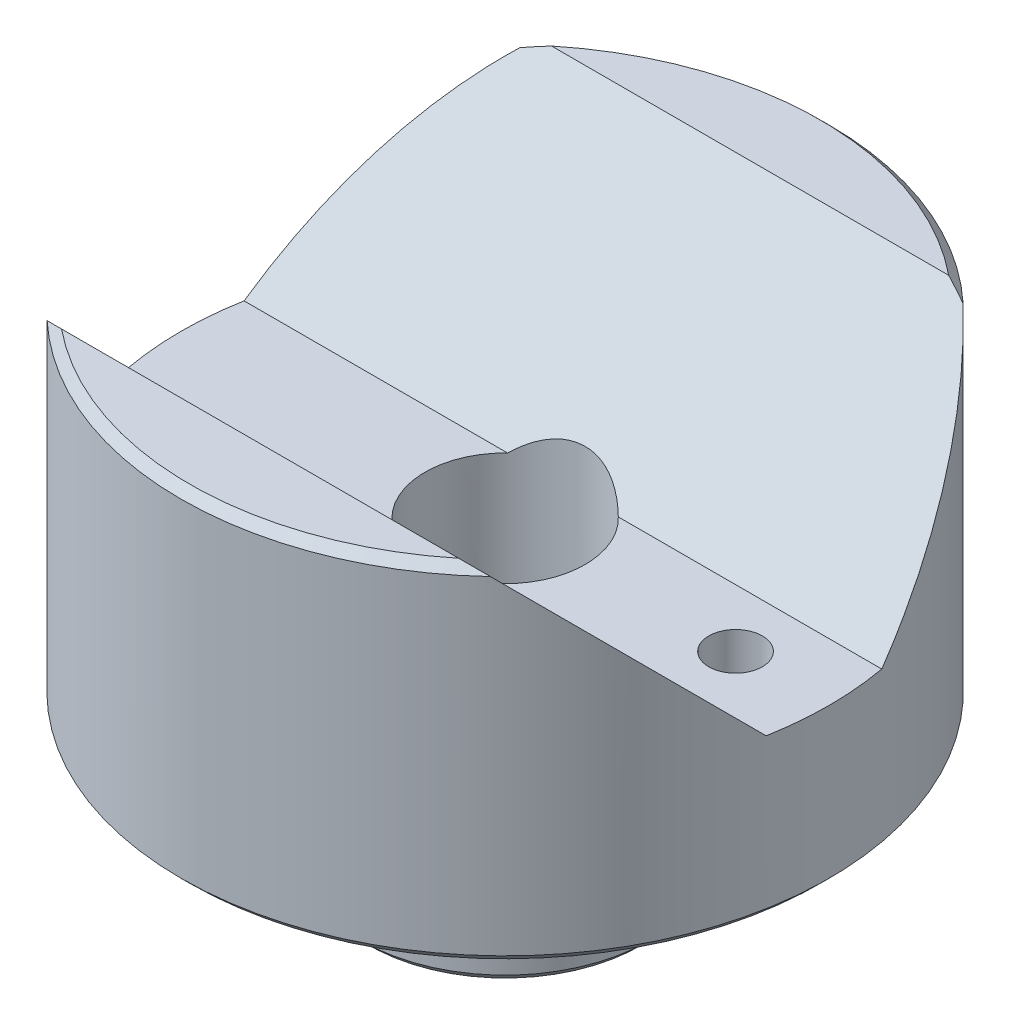
ISO-10303-21;
HEADER;
FILE_DESCRIPTION(('STEP AP214'),'2;1');
FILE_NAME('part.step','',(''),(''),'','','');
FILE_SCHEMA(('AUTOMOTIVE_DESIGN { 1 0 10303 214 1 1 1 1 }'));
ENDSEC;
DATA;
#1=APPLICATION_CONTEXT('core data for automotive mechanical design processes');
#2=APPLICATION_PROTOCOL_DEFINITION('international standard','automotive_design',2000,#1);
#3=PRODUCT_CONTEXT('',#1,'mechanical');
#4=PRODUCT('Part','Part','',(#3));
#5=PRODUCT_RELATED_PRODUCT_CATEGORY('part','',(#4));
#6=PRODUCT_DEFINITION_FORMATION('','',#4);
#7=PRODUCT_DEFINITION_CONTEXT('part definition',#1,'design');
#8=PRODUCT_DEFINITION('design','',#6,#7);
#9=PRODUCT_DEFINITION_SHAPE('','',#8);
#10=(LENGTH_UNIT() NAMED_UNIT(*) SI_UNIT(.MILLI.,.METRE.));
#11=(NAMED_UNIT(*) PLANE_ANGLE_UNIT() SI_UNIT($,.RADIAN.));
#12=(NAMED_UNIT(*) SI_UNIT($,.STERADIAN.) SOLID_ANGLE_UNIT());
#13=UNCERTAINTY_MEASURE_WITH_UNIT(LENGTH_MEASURE(1.E-05),#10,'distance_accuracy_value','');
#14=(GEOMETRIC_REPRESENTATION_CONTEXT(3) GLOBAL_UNCERTAINTY_ASSIGNED_CONTEXT((#13)) GLOBAL_UNIT_ASSIGNED_CONTEXT((#10,
#11,#12)) REPRESENTATION_CONTEXT('',''));
#15=CARTESIAN_POINT('',(0.,0.,0.));
#16=DIRECTION('',(0.,0.,1.));
#17=DIRECTION('',(1.,0.,0.));
#18=AXIS2_PLACEMENT_3D('',#15,#16,#17);
#19=CARTESIAN_POINT('',(0.,0.,0.));
#20=DIRECTION('',(0.,1.,0.));
#21=DIRECTION('',(0.,0.,1.));
#22=AXIS2_PLACEMENT_3D('',#19,#20,#21);
#23=PLANE('',#22);
#24=CARTESIAN_POINT('',(10.16,0.,0.));
#25=DIRECTION('',(0.,1.,0.));
#26=DIRECTION('',(0.,0.,1.));
#27=AXIS2_PLACEMENT_3D('',#24,#25,#26);
#28=CIRCLE('',#27,1.1811);
#29=CARTESIAN_POINT('',(10.16,0.,1.1811));
#30=VERTEX_POINT('',#29);
#31=EDGE_CURVE('E288',#30,#30,#28,.T.);
#32=ORIENTED_EDGE('',*,*,#31,.T.);
#33=EDGE_LOOP('',(#32));
#34=FACE_BOUND('',#33,.T.);
#35=CARTESIAN_POINT('',(0.,0.,0.));
#36=DIRECTION('',(0.,1.,0.));
#37=DIRECTION('',(0.,0.,1.));
#38=AXIS2_PLACEMENT_3D('',#35,#36,#37);
#39=CIRCLE('',#38,13.9065);
#40=CARTESIAN_POINT('',(0.,0.,13.9065));
#41=VERTEX_POINT('',#40);
#42=EDGE_CURVE('E14',#41,#41,#39,.F.);
#43=ORIENTED_EDGE('',*,*,#42,.T.);
#44=EDGE_LOOP('',(#43));
#45=FACE_BOUND('',#44,.T.);
#46=CARTESIAN_POINT('',(0.,0.,0.));
#47=DIRECTION('',(0.,1.,0.));
#48=DIRECTION('',(0.,0.,1.));
#49=AXIS2_PLACEMENT_3D('',#46,#47,#48);
#50=CIRCLE('',#49,7.24948711325939);
#51=CARTESIAN_POINT('',(0.,0.,7.24948711325939));
#52=VERTEX_POINT('',#51);
#53=EDGE_CURVE('E293',#52,#52,#50,.F.);
#54=ORIENTED_EDGE('',*,*,#53,.F.);
#55=EDGE_LOOP('',(#54));
#56=FACE_BOUND('',#55,.T.);
#57=ADVANCED_FACE('F84',(#34,#45,#56),#23,.F.);
#58=CARTESIAN_POINT('',(0.,-6.35,0.));
#59=DIRECTION('',(0.,1.,0.));
#60=DIRECTION('',(0.,0.,1.));
#61=AXIS2_PLACEMENT_3D('',#58,#59,#60);
#62=CYLINDRICAL_SURFACE('',#61,6.35);
#63=CARTESIAN_POINT('',(0.,-5.969,0.));
#64=DIRECTION('',(0.,-1.,0.));
#65=DIRECTION('',(0.,0.,-1.));
#66=AXIS2_PLACEMENT_3D('',#63,#64,#65);
#67=CIRCLE('',#66,6.35);
#68=CARTESIAN_POINT('',(0.,-5.969,-6.35));
#69=VERTEX_POINT('',#68);
#70=EDGE_CURVE('E212',#69,#69,#67,.F.);
#71=ORIENTED_EDGE('',*,*,#70,.T.);
#72=EDGE_LOOP('',(#71));
#73=FACE_BOUND('',#72,.T.);
#74=CARTESIAN_POINT('',(0.,-0.803926131403118,0.));
#75=DIRECTION('',(0.,1.,0.));
#76=DIRECTION('',(0.,0.,1.));
#77=AXIS2_PLACEMENT_3D('',#74,#75,#76);
#78=CIRCLE('',#77,6.35);
#79=CARTESIAN_POINT('',(0.,-0.803926131403118,6.35));
#80=VERTEX_POINT('',#79);
#81=EDGE_CURVE('E88',#80,#80,#78,.T.);
#82=ORIENTED_EDGE('',*,*,#81,.F.);
#83=EDGE_LOOP('',(#82));
#84=FACE_BOUND('',#83,.T.);
#85=ADVANCED_FACE('F240',(#73,#84),#62,.T.);
#86=CARTESIAN_POINT('',(-14.2875,6.985,-2.54838418160373));
#87=DIRECTION('',(0.,-1.,0.));
#88=DIRECTION('',(0.,0.,-1.));
#89=AXIS2_PLACEMENT_3D('',#86,#87,#88);
#90=PLANE('',#89);
#91=CARTESIAN_POINT('',(0.,6.985,0.));
#92=DIRECTION('',(0.,-1.,0.));
#93=DIRECTION('',(0.,0.,-1.));
#94=AXIS2_PLACEMENT_3D('',#91,#92,#93);
#95=CIRCLE('',#94,3.5306);
#96=CARTESIAN_POINT('',(-2.44353727676742,6.985,-2.54838418160373));
#97=VERTEX_POINT('',#96);
#98=CARTESIAN_POINT('',(-2.44353727676741,6.985,2.54838418160373));
#99=VERTEX_POINT('',#98);
#100=EDGE_CURVE('E154',#97,#99,#95,.F.);
#101=ORIENTED_EDGE('',*,*,#100,.F.);
#102=DIRECTION('',(1.,0.,0.));
#103=VECTOR('',#102,1.);
#104=CARTESIAN_POINT('',(-14.2875,6.985,-2.54838418160373));
#105=LINE('',#104,#103);
#106=CARTESIAN_POINT('',(-14.0583923089716,6.985,-2.54838418160373));
#107=VERTEX_POINT('',#106);
#108=EDGE_CURVE('E170',#107,#97,#105,.T.);
#109=ORIENTED_EDGE('',*,*,#108,.F.);
#110=CARTESIAN_POINT('',(0.,6.985,0.));
#111=DIRECTION('',(0.,-1.,0.));
#112=DIRECTION('',(0.,0.,-1.));
#113=AXIS2_PLACEMENT_3D('',#110,#111,#112);
#114=CIRCLE('',#113,14.2875);
#115=CARTESIAN_POINT('',(-14.0583923089716,6.985,2.54838418160373));
#116=VERTEX_POINT('',#115);
#117=EDGE_CURVE('E163',#116,#107,#114,.T.);
#118=ORIENTED_EDGE('',*,*,#117,.F.);
#119=DIRECTION('',(1.,0.,0.));
#120=VECTOR('',#119,1.);
#121=CARTESIAN_POINT('',(-14.2875,6.985,2.54838418160373));
#122=LINE('',#121,#120);
#123=EDGE_CURVE('E173',#116,#99,#122,.T.);
#124=ORIENTED_EDGE('',*,*,#123,.T.);
#125=EDGE_LOOP('',(#101,#109,#118,#124));
#126=FACE_BOUND('',#125,.T.);
#127=ADVANCED_FACE('F168',(#126),#90,.F.);
#128=CARTESIAN_POINT('',(10.16,6.985,0.));
#129=DIRECTION('',(0.,1.,0.));
#130=DIRECTION('',(0.,0.,1.));
#131=AXIS2_PLACEMENT_3D('',#128,#129,#130);
#132=CIRCLE('',#131,1.1811);
#133=CARTESIAN_POINT('',(10.16,6.985,1.1811));
#134=VERTEX_POINT('',#133);
#135=EDGE_CURVE('E302',#134,#134,#132,.T.);
#136=ORIENTED_EDGE('',*,*,#135,.F.);
#137=EDGE_LOOP('',(#136));
#138=FACE_BOUND('',#137,.T.);
#139=CARTESIAN_POINT('',(2.44353727676741,6.985,2.54838418160373));
#140=VERTEX_POINT('',#139);
#141=CARTESIAN_POINT('',(2.4435372767674,6.985,-2.54838418160373));
#142=VERTEX_POINT('',#141);
#143=EDGE_CURVE('E157',#140,#142,#95,.F.);
#144=ORIENTED_EDGE('',*,*,#143,.F.);
#145=CARTESIAN_POINT('',(14.0583923089716,6.985,2.54838418160373));
#146=VERTEX_POINT('',#145);
#147=EDGE_CURVE('E186',#140,#146,#122,.T.);
#148=ORIENTED_EDGE('',*,*,#147,.T.);
#149=CARTESIAN_POINT('',(14.0583923089716,6.985,-2.54838418160373));
#150=VERTEX_POINT('',#149);
#151=EDGE_CURVE('E195',#150,#146,#114,.T.);
#152=ORIENTED_EDGE('',*,*,#151,.F.);
#153=EDGE_CURVE('E181',#142,#150,#105,.T.);
#154=ORIENTED_EDGE('',*,*,#153,.F.);
#155=EDGE_LOOP('',(#144,#148,#152,#154));
#156=FACE_BOUND('',#155,.T.);
#157=ADVANCED_FACE('F245',(#138,#156),#90,.F.);
#158=CARTESIAN_POINT('',(-14.2875,6.985,2.54838418160373));
#159=DIRECTION('',(0.,-0.707106781186548,0.707106781186547));
#160=DIRECTION('',(0.,-0.707106781186547,-0.707106781186548));
#161=AXIS2_PLACEMENT_3D('',#158,#159,#160);
#162=PLANE('',#161);
#163=DIRECTION('',(1.,0.,0.));
#164=VECTOR('',#163,1.);
#165=CARTESIAN_POINT('',(0.,15.24,10.8033841816037));
#166=LINE('',#165,#164);
#167=CARTESIAN_POINT('',(-8.7565765270838,15.24,10.8033841816037));
#168=VERTEX_POINT('',#167);
#169=CARTESIAN_POINT('',(8.7565765270838,15.24,10.8033841816037));
#170=VERTEX_POINT('',#169);
#171=EDGE_CURVE('E193',#168,#170,#166,.T.);
#172=ORIENTED_EDGE('',*,*,#171,.T.);
#173=CARTESIAN_POINT('',(8.7565765270838,15.24,10.8033841816037));
#174=CARTESIAN_POINT('',(8.84227947885759,15.2096289773404,10.7730131589442));
#175=CARTESIAN_POINT('',(8.92772964032835,15.1789016635917,10.7422858451955));
#176=CARTESIAN_POINT('',(9.09811127153115,15.1167549928,10.6801391744038));
#177=CARTESIAN_POINT('',(9.1830428066349,15.0853357253763,10.64871990698));
#178=CARTESIAN_POINT('',(9.3523957525754,15.0218180037477,10.5852021853514));
#179=CARTESIAN_POINT('',(9.43681716577958,14.989719552698,10.5531037343017));
#180=CARTESIAN_POINT('',(9.6051598288421,14.9248553166724,10.4882394982762));
#181=CARTESIAN_POINT('',(9.68908101288975,14.8920894462902,10.4554736278939));
#182=CARTESIAN_POINT('',(9.77274599184159,14.859,10.4223841816038));
#183=B_SPLINE_CURVE_WITH_KNOTS('',3,(#173,#174,#175,#176,#177,#178,#179,#180,#181,#182),
.UNSPECIFIED.,.F.,.F.,(4,2,2,2,4),(0.,0.287588236579071,0.575139442343968,0.862689312573672,
1.15027621324248),.UNSPECIFIED.);
#184=CARTESIAN_POINT('',(9.77274599184159,14.859,10.4223841816038));
#185=VERTEX_POINT('',#184);
#186=EDGE_CURVE('E93',#170,#185,#183,.T.);
#187=ORIENTED_EDGE('',*,*,#186,.T.);
#188=CARTESIAN_POINT('',(0.,4.43661581839627,0.));
#189=DIRECTION('',(0.,-0.707106781186548,0.707106781186547));
#190=DIRECTION('',(0.,-0.707106781186547,-0.707106781186548));
#191=AXIS2_PLACEMENT_3D('',#188,#189,#190);
#192=ELLIPSE('',#191,20.2055762724056,14.2875);
#193=EDGE_CURVE('E190',#146,#185,#192,.T.);
#194=ORIENTED_EDGE('',*,*,#193,.F.);
#195=ORIENTED_EDGE('',*,*,#147,.F.);
#196=CARTESIAN_POINT('',(0.,4.43661581839627,0.));
#197=DIRECTION('',(0.,-0.707106781186548,0.707106781186547));
#198=DIRECTION('',(0.,0.707106781186547,0.707106781186548));
#199=AXIS2_PLACEMENT_3D('',#196,#197,#198);
#200=ELLIPSE('',#199,4.99302240331445,3.5306);
#201=EDGE_CURVE('E174',#99,#140,#200,.F.);
#202=ORIENTED_EDGE('',*,*,#201,.F.);
#203=ORIENTED_EDGE('',*,*,#123,.F.);
#204=CARTESIAN_POINT('',(-9.77274599184159,14.859,10.4223841816038));
#205=VERTEX_POINT('',#204);
#206=EDGE_CURVE('E188',#205,#116,#192,.T.);
#207=ORIENTED_EDGE('',*,*,#206,.F.);
#208=CARTESIAN_POINT('',(-9.77274599184159,14.859,10.4223841816038));
#209=CARTESIAN_POINT('',(-9.68908101288975,14.8920894462902,10.4554736278939));
#210=CARTESIAN_POINT('',(-9.6051598288421,14.9248553166724,10.4882394982762));
#211=CARTESIAN_POINT('',(-9.43681716577958,14.989719552698,10.5531037343017));
#212=CARTESIAN_POINT('',(-9.3523957525754,15.0218180037477,10.5852021853514));
#213=CARTESIAN_POINT('',(-9.1830428066349,15.0853357253763,10.64871990698));
#214=CARTESIAN_POINT('',(-9.09811127153115,15.1167549928,10.6801391744038));
#215=CARTESIAN_POINT('',(-8.92772964032835,15.1789016635917,10.7422858451955));
#216=CARTESIAN_POINT('',(-8.84227947885759,15.2096289773404,10.7730131589442));
#217=CARTESIAN_POINT('',(-8.7565765270838,15.24,10.8033841816037));
#218=B_SPLINE_CURVE_WITH_KNOTS('',3,(#208,#209,#210,#211,#212,#213,#214,#215,#216,#217),
.UNSPECIFIED.,.F.,.F.,(4,2,2,2,4),(0.,0.287586900668809,0.575136770898513,0.862687976663411,
1.15027621324248),.UNSPECIFIED.);
#219=EDGE_CURVE('E107',#205,#168,#218,.T.);
#220=ORIENTED_EDGE('',*,*,#219,.T.);
#221=EDGE_LOOP('',(#172,#187,#194,#195,#202,#203,#207,#220));
#222=FACE_BOUND('',#221,.T.);
#223=ADVANCED_FACE('F239',(#222),#162,.F.);
#224=CARTESIAN_POINT('',(-14.2875,15.24,-10.8033841816037));
#225=DIRECTION('',(0.,-0.707106781186548,-0.707106781186547));
#226=DIRECTION('',(0.,0.707106781186547,-0.707106781186548));
#227=AXIS2_PLACEMENT_3D('',#224,#225,#226);
#228=PLANE('',#227);
#229=DIRECTION('',(-1.,0.,0.));
#230=VECTOR('',#229,1.);
#231=CARTESIAN_POINT('',(0.,15.24,-10.8033841816037));
#232=LINE('',#231,#230);
#233=CARTESIAN_POINT('',(8.7565765270838,15.24,-10.8033841816037));
#234=VERTEX_POINT('',#233);
#235=CARTESIAN_POINT('',(-8.7565765270838,15.24,-10.8033841816037));
#236=VERTEX_POINT('',#235);
#237=EDGE_CURVE('E191',#234,#236,#232,.T.);
#238=ORIENTED_EDGE('',*,*,#237,.T.);
#239=CARTESIAN_POINT('',(-8.7565765270838,15.24,-10.8033841816037));
#240=CARTESIAN_POINT('',(-8.84227947885759,15.2096289773404,-10.7730131589442));
#241=CARTESIAN_POINT('',(-8.92772964032835,15.1789016635917,-10.7422858451955));
#242=CARTESIAN_POINT('',(-9.09811127153116,15.1167549928,-10.6801391744038));
#243=CARTESIAN_POINT('',(-9.18304280663491,15.0853357253763,-10.64871990698));
#244=CARTESIAN_POINT('',(-9.3523957525754,15.0218180037477,-10.5852021853514));
#245=CARTESIAN_POINT('',(-9.43681716577959,14.989719552698,-10.5531037343017));
#246=CARTESIAN_POINT('',(-9.60515982884211,14.9248553166724,-10.4882394982762));
#247=CARTESIAN_POINT('',(-9.68908101288976,14.8920894462902,-10.4554736278939));
#248=CARTESIAN_POINT('',(-9.77274599184159,14.859,-10.4223841816038));
#249=B_SPLINE_CURVE_WITH_KNOTS('',3,(#239,#240,#241,#242,#243,#244,#245,#246,#247,#248),
.UNSPECIFIED.,.F.,.F.,(4,2,2,2,4),(0.,0.287588236579072,0.575139442343968,0.862689312573673,
1.15027621324248),.UNSPECIFIED.);
#250=CARTESIAN_POINT('',(-9.77274599184159,14.859,-10.4223841816038));
#251=VERTEX_POINT('',#250);
#252=EDGE_CURVE('E225',#236,#251,#249,.T.);
#253=ORIENTED_EDGE('',*,*,#252,.T.);
#254=CARTESIAN_POINT('',(0.,4.43661581839627,0.));
#255=DIRECTION('',(0.,-0.707106781186548,-0.707106781186547));
#256=DIRECTION('',(0.,-0.707106781186547,0.707106781186548));
#257=AXIS2_PLACEMENT_3D('',#254,#255,#256);
#258=ELLIPSE('',#257,20.2055762724056,14.2875);
#259=EDGE_CURVE('E179',#107,#251,#258,.T.);
#260=ORIENTED_EDGE('',*,*,#259,.F.);
#261=ORIENTED_EDGE('',*,*,#108,.T.);
#262=CARTESIAN_POINT('',(0.,4.43661581839627,0.));
#263=DIRECTION('',(0.,-0.707106781186548,-0.707106781186547));
#264=DIRECTION('',(0.,0.707106781186547,-0.707106781186548));
#265=AXIS2_PLACEMENT_3D('',#262,#263,#264);
#266=ELLIPSE('',#265,4.99302240331445,3.5306);
#267=EDGE_CURVE('E151',#142,#97,#266,.F.);
#268=ORIENTED_EDGE('',*,*,#267,.F.);
#269=ORIENTED_EDGE('',*,*,#153,.T.);
#270=CARTESIAN_POINT('',(9.77274599184159,14.859,-10.4223841816038));
#271=VERTEX_POINT('',#270);
#272=EDGE_CURVE('E180',#271,#150,#258,.T.);
#273=ORIENTED_EDGE('',*,*,#272,.F.);
#274=CARTESIAN_POINT('',(9.77274599184159,14.859,-10.4223841816038));
#275=CARTESIAN_POINT('',(9.68908101288976,14.8920894462902,-10.4554736278939));
#276=CARTESIAN_POINT('',(9.60515982884211,14.9248553166724,-10.4882394982762));
#277=CARTESIAN_POINT('',(9.43681716577959,14.989719552698,-10.5531037343017));
#278=CARTESIAN_POINT('',(9.3523957525754,15.0218180037477,-10.5852021853514));
#279=CARTESIAN_POINT('',(9.18304280663491,15.0853357253763,-10.64871990698));
#280=CARTESIAN_POINT('',(9.09811127153116,15.1167549928,-10.6801391744038));
#281=CARTESIAN_POINT('',(8.92772964032835,15.1789016635917,-10.7422858451955));
#282=CARTESIAN_POINT('',(8.84227947885759,15.2096289773404,-10.7730131589442));
#283=CARTESIAN_POINT('',(8.7565765270838,15.24,-10.8033841816037));
#284=B_SPLINE_CURVE_WITH_KNOTS('',3,(#274,#275,#276,#277,#278,#279,#280,#281,#282,#283),
.UNSPECIFIED.,.F.,.F.,(4,2,2,2,4),(0.,0.287586900668807,0.575136770898512,0.862687976663411,
1.15027621324248),.UNSPECIFIED.);
#285=EDGE_CURVE('E218',#271,#234,#284,.T.);
#286=ORIENTED_EDGE('',*,*,#285,.T.);
#287=EDGE_LOOP('',(#238,#253,#260,#261,#268,#269,#273,#286));
#288=FACE_BOUND('',#287,.T.);
#289=ADVANCED_FACE('F177',(#288),#228,.F.);
#290=CARTESIAN_POINT('',(0.,-6.35,0.));
#291=DIRECTION('',(0.,-1.,0.));
#292=DIRECTION('',(0.,0.,-1.));
#293=AXIS2_PLACEMENT_3D('',#290,#291,#292);
#294=PLANE('',#293);
#295=CARTESIAN_POINT('',(0.,-6.35,0.));
#296=DIRECTION('',(0.,-1.,0.));
#297=DIRECTION('',(0.,0.,-1.));
#298=AXIS2_PLACEMENT_3D('',#295,#296,#297);
#299=CIRCLE('',#298,5.969);
#300=CARTESIAN_POINT('',(0.,-6.35,-5.969));
#301=VERTEX_POINT('',#300);
#302=EDGE_CURVE('E209',#301,#301,#299,.T.);
#303=ORIENTED_EDGE('',*,*,#302,.T.);
#304=EDGE_LOOP('',(#303));
#305=FACE_BOUND('',#304,.T.);
#306=CARTESIAN_POINT('',(0.,-6.35,0.));
#307=DIRECTION('',(0.,-1.,0.));
#308=DIRECTION('',(0.,0.,-1.));
#309=AXIS2_PLACEMENT_3D('',#306,#307,#308);
#310=CIRCLE('',#309,3.175);
#311=CARTESIAN_POINT('',(0.,-6.35,-3.175));
#312=VERTEX_POINT('',#311);
#313=EDGE_CURVE('E162',#312,#312,#310,.F.);
#314=ORIENTED_EDGE('',*,*,#313,.T.);
#315=EDGE_LOOP('',(#314));
#316=FACE_BOUND('',#315,.T.);
#317=ADVANCED_FACE('F238',(#305,#316),#294,.T.);
#318=CARTESIAN_POINT('',(0.,15.24,0.));
#319=DIRECTION('',(0.,1.,0.));
#320=DIRECTION('',(0.,0.,1.));
#321=AXIS2_PLACEMENT_3D('',#318,#319,#320);
#322=PLANE('',#321);
#323=ORIENTED_EDGE('',*,*,#171,.F.);
#324=CARTESIAN_POINT('',(0.,15.24,0.));
#325=DIRECTION('',(0.,1.,0.));
#326=DIRECTION('',(0.,0.,1.));
#327=AXIS2_PLACEMENT_3D('',#324,#325,#326);
#328=CIRCLE('',#327,13.9065);
#329=EDGE_CURVE('E323',#168,#170,#328,.T.);
#330=ORIENTED_EDGE('',*,*,#329,.T.);
#331=EDGE_LOOP('',(#323,#330));
#332=FACE_BOUND('',#331,.T.);
#333=ADVANCED_FACE('F332',(#332),#322,.T.);
#334=CARTESIAN_POINT('',(0.,15.24,0.));
#335=DIRECTION('',(0.,-1.,0.));
#336=DIRECTION('',(0.,0.,-1.));
#337=AXIS2_PLACEMENT_3D('',#334,#335,#336);
#338=CYLINDRICAL_SURFACE('',#337,14.2875);
#339=CARTESIAN_POINT('',(0.,0.381000000000008,0.));
#340=DIRECTION('',(0.,1.,0.));
#341=DIRECTION('',(0.,0.,1.));
#342=AXIS2_PLACEMENT_3D('',#339,#340,#341);
#343=CIRCLE('',#342,14.2875);
#344=CARTESIAN_POINT('',(0.,0.381000000000008,14.2875));
#345=VERTEX_POINT('',#344);
#346=EDGE_CURVE('E321',#345,#345,#343,.T.);
#347=ORIENTED_EDGE('',*,*,#346,.T.);
#348=EDGE_LOOP('',(#347));
#349=FACE_BOUND('',#348,.T.);
#350=ORIENTED_EDGE('',*,*,#259,.T.);
#351=CARTESIAN_POINT('',(0.,14.859,0.));
#352=DIRECTION('',(0.,1.,0.));
#353=DIRECTION('',(0.,0.,1.));
#354=AXIS2_PLACEMENT_3D('',#351,#352,#353);
#355=CIRCLE('',#354,14.2875);
#356=EDGE_CURVE('E314',#251,#271,#355,.F.);
#357=ORIENTED_EDGE('',*,*,#356,.T.);
#358=ORIENTED_EDGE('',*,*,#272,.T.);
#359=ORIENTED_EDGE('',*,*,#151,.T.);
#360=ORIENTED_EDGE('',*,*,#193,.T.);
#361=CARTESIAN_POINT('',(0.,14.859,0.));
#362=DIRECTION('',(0.,1.,0.));
#363=DIRECTION('',(0.,0.,1.));
#364=AXIS2_PLACEMENT_3D('',#361,#362,#363);
#365=CIRCLE('',#364,14.2875);
#366=EDGE_CURVE('E322',#185,#205,#365,.F.);
#367=ORIENTED_EDGE('',*,*,#366,.T.);
#368=ORIENTED_EDGE('',*,*,#206,.T.);
#369=ORIENTED_EDGE('',*,*,#117,.T.);
#370=EDGE_LOOP('',(#350,#357,#358,#359,#360,#367,#368,#369));
#371=FACE_BOUND('',#370,.T.);
#372=ADVANCED_FACE('F86',(#349,#371),#338,.T.);
#373=ORIENTED_EDGE('',*,*,#237,.F.);
#374=CARTESIAN_POINT('',(0.,15.24,0.));
#375=DIRECTION('',(0.,1.,0.));
#376=DIRECTION('',(0.,0.,1.));
#377=AXIS2_PLACEMENT_3D('',#374,#375,#376);
#378=CIRCLE('',#377,13.9065);
#379=EDGE_CURVE('E215',#234,#236,#378,.T.);
#380=ORIENTED_EDGE('',*,*,#379,.T.);
#381=EDGE_LOOP('',(#373,#380));
#382=FACE_BOUND('',#381,.T.);
#383=ADVANCED_FACE('F320',(#382),#322,.T.);
#384=CARTESIAN_POINT('',(0.,13.9793934911243,0.));
#385=DIRECTION('',(0.,1.,0.));
#386=DIRECTION('',(0.,0.,1.));
#387=AXIS2_PLACEMENT_3D('',#384,#385,#386);
#388=CYLINDRICAL_SURFACE('',#387,3.5306);
#389=CARTESIAN_POINT('',(0.,0.635,0.));
#390=DIRECTION('',(0.,1.,0.));
#391=DIRECTION('',(0.,0.,1.));
#392=AXIS2_PLACEMENT_3D('',#389,#390,#391);
#393=CIRCLE('',#392,3.5306);
#394=CARTESIAN_POINT('',(0.,0.635,3.5306));
#395=VERTEX_POINT('',#394);
#396=EDGE_CURVE('E295',#395,#395,#393,.T.);
#397=ORIENTED_EDGE('',*,*,#396,.F.);
#398=EDGE_LOOP('',(#397));
#399=FACE_BOUND('',#398,.T.);
#400=ORIENTED_EDGE('',*,*,#201,.T.);
#401=ORIENTED_EDGE('',*,*,#143,.T.);
#402=ORIENTED_EDGE('',*,*,#267,.T.);
#403=ORIENTED_EDGE('',*,*,#100,.T.);
#404=EDGE_LOOP('',(#400,#401,#402,#403));
#405=FACE_BOUND('',#404,.T.);
#406=ADVANCED_FACE('F153',(#399,#405),#388,.F.);
#407=CARTESIAN_POINT('',(0.,13.9793934911243,0.));
#408=DIRECTION('',(0.,1.,0.));
#409=DIRECTION('',(0.,0.,1.));
#410=AXIS2_PLACEMENT_3D('',#407,#408,#409);
#411=CYLINDRICAL_SURFACE('',#410,2.5527);
#412=CARTESIAN_POINT('',(0.,-5.7277,0.));
#413=DIRECTION('',(0.,-1.,0.));
#414=DIRECTION('',(0.,0.,-1.));
#415=AXIS2_PLACEMENT_3D('',#412,#413,#414);
#416=CIRCLE('',#415,2.5527);
#417=CARTESIAN_POINT('',(0.,-5.7277,-2.5527));
#418=VERTEX_POINT('',#417);
#419=EDGE_CURVE('E203',#418,#418,#416,.T.);
#420=ORIENTED_EDGE('',*,*,#419,.T.);
#421=EDGE_LOOP('',(#420));
#422=FACE_BOUND('',#421,.T.);
#423=CARTESIAN_POINT('',(0.,0.0126999999999905,0.));
#424=DIRECTION('',(0.,1.,0.));
#425=DIRECTION('',(0.,0.,1.));
#426=AXIS2_PLACEMENT_3D('',#423,#424,#425);
#427=CIRCLE('',#426,2.5527);
#428=CARTESIAN_POINT('',(0.,0.0126999999999905,2.5527));
#429=VERTEX_POINT('',#428);
#430=EDGE_CURVE('E200',#429,#429,#427,.T.);
#431=ORIENTED_EDGE('',*,*,#430,.T.);
#432=EDGE_LOOP('',(#431));
#433=FACE_BOUND('',#432,.T.);
#434=ADVANCED_FACE('F345',(#422,#433),#411,.F.);
#435=CARTESIAN_POINT('',(2.5527,0.635,0.));
#436=DIRECTION('',(0.,1.,0.));
#437=DIRECTION('',(0.,0.,1.));
#438=AXIS2_PLACEMENT_3D('',#435,#436,#437);
#439=PLANE('',#438);
#440=CARTESIAN_POINT('',(0.,0.635,0.));
#441=DIRECTION('',(0.,1.,0.));
#442=DIRECTION('',(0.,0.,1.));
#443=AXIS2_PLACEMENT_3D('',#440,#441,#442);
#444=CIRCLE('',#443,3.17500000000001);
#445=CARTESIAN_POINT('',(0.,0.635,3.17500000000001));
#446=VERTEX_POINT('',#445);
#447=EDGE_CURVE('E206',#446,#446,#444,.F.);
#448=ORIENTED_EDGE('',*,*,#447,.T.);
#449=EDGE_LOOP('',(#448));
#450=FACE_BOUND('',#449,.T.);
#451=ORIENTED_EDGE('',*,*,#396,.T.);
#452=EDGE_LOOP('',(#451));
#453=FACE_BOUND('',#452,.T.);
#454=ADVANCED_FACE('F348',(#450,#453),#439,.T.);
#455=CARTESIAN_POINT('',(0.,-6.35,0.));
#456=DIRECTION('',(0.,-1.,0.));
#457=DIRECTION('',(0.,0.,-1.));
#458=AXIS2_PLACEMENT_3D('',#455,#456,#457);
#459=CONICAL_SURFACE('',#458,3.175,0.785398163397445);
#460=ORIENTED_EDGE('',*,*,#419,.F.);
#461=EDGE_LOOP('',(#460));
#462=FACE_BOUND('',#461,.T.);
#463=ORIENTED_EDGE('',*,*,#313,.F.);
#464=EDGE_LOOP('',(#463));
#465=FACE_BOUND('',#464,.T.);
#466=ADVANCED_FACE('F352',(#462,#465),#459,.F.);
#467=CARTESIAN_POINT('',(0.,0.0126999999999905,0.));
#468=DIRECTION('',(0.,1.,0.));
#469=DIRECTION('',(0.,0.,1.));
#470=AXIS2_PLACEMENT_3D('',#467,#468,#469);
#471=CONICAL_SURFACE('',#470,2.5527,0.785398163397448);
#472=ORIENTED_EDGE('',*,*,#447,.F.);
#473=EDGE_LOOP('',(#472));
#474=FACE_BOUND('',#473,.T.);
#475=ORIENTED_EDGE('',*,*,#430,.F.);
#476=EDGE_LOOP('',(#475));
#477=FACE_BOUND('',#476,.T.);
#478=ADVANCED_FACE('F359',(#474,#477),#471,.F.);
#479=CARTESIAN_POINT('',(0.,-6.35,0.));
#480=DIRECTION('',(0.,1.,0.));
#481=DIRECTION('',(0.,0.,1.));
#482=AXIS2_PLACEMENT_3D('',#479,#480,#481);
#483=CONICAL_SURFACE('',#482,5.969,0.785398163397448);
#484=ORIENTED_EDGE('',*,*,#70,.F.);
#485=EDGE_LOOP('',(#484));
#486=FACE_BOUND('',#485,.T.);
#487=ORIENTED_EDGE('',*,*,#302,.F.);
#488=EDGE_LOOP('',(#487));
#489=FACE_BOUND('',#488,.T.);
#490=ADVANCED_FACE('F362',(#486,#489),#483,.T.);
#491=CARTESIAN_POINT('',(0.,15.24,0.));
#492=DIRECTION('',(0.,-1.,0.));
#493=DIRECTION('',(0.,0.,-1.));
#494=AXIS2_PLACEMENT_3D('',#491,#492,#493);
#495=CONICAL_SURFACE('',#494,13.9065,0.785398163397446);
#496=ORIENTED_EDGE('',*,*,#285,.F.);
#497=ORIENTED_EDGE('',*,*,#356,.F.);
#498=ORIENTED_EDGE('',*,*,#252,.F.);
#499=ORIENTED_EDGE('',*,*,#379,.F.);
#500=EDGE_LOOP('',(#496,#497,#498,#499));
#501=FACE_BOUND('',#500,.T.);
#502=ADVANCED_FACE('F230',(#501),#495,.T.);
#503=CARTESIAN_POINT('',(0.,15.24,0.));
#504=DIRECTION('',(0.,-1.,0.));
#505=DIRECTION('',(0.,0.,-1.));
#506=AXIS2_PLACEMENT_3D('',#503,#504,#505);
#507=CONICAL_SURFACE('',#506,13.9065,0.785398163397446);
#508=ORIENTED_EDGE('',*,*,#219,.F.);
#509=ORIENTED_EDGE('',*,*,#366,.F.);
#510=ORIENTED_EDGE('',*,*,#186,.F.);
#511=ORIENTED_EDGE('',*,*,#329,.F.);
#512=EDGE_LOOP('',(#508,#509,#510,#511));
#513=FACE_BOUND('',#512,.T.);
#514=ADVANCED_FACE('F259',(#513),#507,.T.);
#515=CARTESIAN_POINT('',(0.,0.381000000000008,0.));
#516=DIRECTION('',(0.,1.,0.));
#517=DIRECTION('',(0.,0.,1.));
#518=AXIS2_PLACEMENT_3D('',#515,#516,#517);
#519=CONICAL_SURFACE('',#518,14.2875,0.785398163397448);
#520=ORIENTED_EDGE('',*,*,#42,.F.);
#521=EDGE_LOOP('',(#520));
#522=FACE_BOUND('',#521,.T.);
#523=ORIENTED_EDGE('',*,*,#346,.F.);
#524=EDGE_LOOP('',(#523));
#525=FACE_BOUND('',#524,.T.);
#526=ADVANCED_FACE('F263',(#522,#525),#519,.T.);
#527=CARTESIAN_POINT('',(0.,-0.254,0.));
#528=DIRECTION('',(0.,1.,0.));
#529=DIRECTION('',(0.,0.,1.));
#530=AXIS2_PLACEMENT_3D('',#527,#528,#529);
#531=TOROIDAL_SURFACE('',#530,6.6675,0.635000000000001);
#532=ORIENTED_EDGE('',*,*,#81,.T.);
#533=EDGE_LOOP('',(#532));
#534=FACE_BOUND('',#533,.T.);
#535=ORIENTED_EDGE('',*,*,#53,.T.);
#536=EDGE_LOOP('',(#535));
#537=FACE_BOUND('',#536,.T.);
#538=ADVANCED_FACE('F267',(#534,#537),#531,.F.);
#539=CARTESIAN_POINT('',(10.16,-6.35,0.));
#540=DIRECTION('',(0.,1.,0.));
#541=DIRECTION('',(0.,0.,1.));
#542=AXIS2_PLACEMENT_3D('',#539,#540,#541);
#543=CYLINDRICAL_SURFACE('',#542,1.1811);
#544=ORIENTED_EDGE('',*,*,#135,.T.);
#545=EDGE_LOOP('',(#544));
#546=FACE_BOUND('',#545,.T.);
#547=ORIENTED_EDGE('',*,*,#31,.F.);
#548=EDGE_LOOP('',(#547));
#549=FACE_BOUND('',#548,.T.);
#550=ADVANCED_FACE('F271',(#546,#549),#543,.F.);
#551=CLOSED_SHELL('',(#57,#85,#127,#157,#223,#289,#317,#333,#372,#383,#406,#434,#454,#466,#478,
#490,#502,#514,#526,#538,#550));
#552=MANIFOLD_SOLID_BREP('B2',#551);
#553=ADVANCED_BREP_SHAPE_REPRESENTATION('',(#18,#552),#14);
#554=SHAPE_DEFINITION_REPRESENTATION(#9,#553);
ENDSEC;
END-ISO-10303-21;
